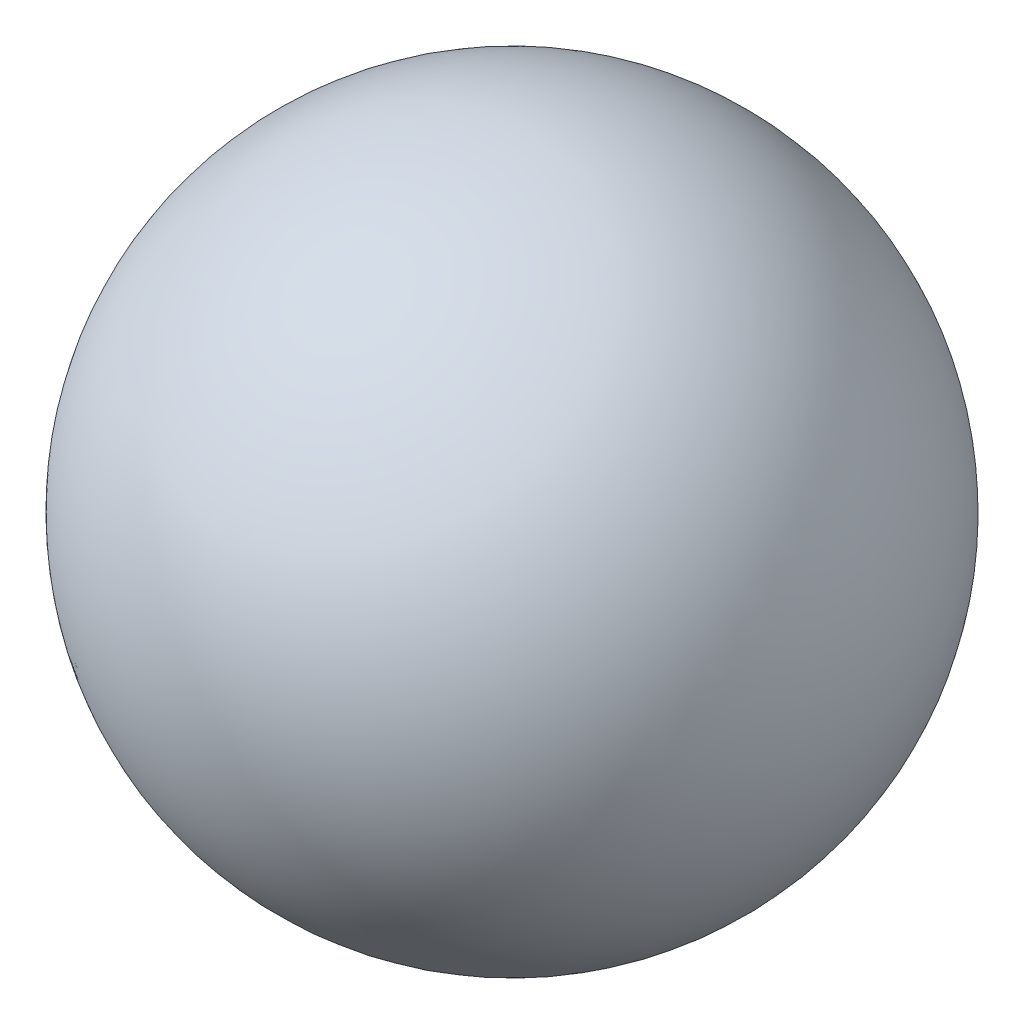
ISO-10303-21;
HEADER;
FILE_DESCRIPTION(('STEP AP214'),'2;1');
FILE_NAME('part.step','',(''),(''),'','','');
FILE_SCHEMA(('AUTOMOTIVE_DESIGN { 1 0 10303 214 1 1 1 1 }'));
ENDSEC;
DATA;
#1=APPLICATION_CONTEXT('core data for automotive mechanical design processes');
#2=APPLICATION_PROTOCOL_DEFINITION('international standard','automotive_design',2000,#1);
#3=PRODUCT_CONTEXT('',#1,'mechanical');
#4=PRODUCT('Part','Part','',(#3));
#5=PRODUCT_RELATED_PRODUCT_CATEGORY('part','',(#4));
#6=PRODUCT_DEFINITION_FORMATION('','',#4);
#7=PRODUCT_DEFINITION_CONTEXT('part definition',#1,'design');
#8=PRODUCT_DEFINITION('design','',#6,#7);
#9=PRODUCT_DEFINITION_SHAPE('','',#8);
#10=(LENGTH_UNIT() NAMED_UNIT(*) SI_UNIT(.MILLI.,.METRE.));
#11=(NAMED_UNIT(*) PLANE_ANGLE_UNIT() SI_UNIT($,.RADIAN.));
#12=(NAMED_UNIT(*) SI_UNIT($,.STERADIAN.) SOLID_ANGLE_UNIT());
#13=UNCERTAINTY_MEASURE_WITH_UNIT(LENGTH_MEASURE(1.E-05),#10,'distance_accuracy_value','');
#14=(GEOMETRIC_REPRESENTATION_CONTEXT(3) GLOBAL_UNCERTAINTY_ASSIGNED_CONTEXT((#13)) GLOBAL_UNIT_ASSIGNED_CONTEXT((#10,
#11,#12)) REPRESENTATION_CONTEXT('',''));
#15=CARTESIAN_POINT('',(0.,0.,0.));
#16=DIRECTION('',(0.,0.,1.));
#17=DIRECTION('',(1.,0.,0.));
#18=AXIS2_PLACEMENT_3D('',#15,#16,#17);
#19=CARTESIAN_POINT('',(0.,-2.36880771697495,-2.36880771697492));
#20=DIRECTION('',(0.0632926493718599,0.39825974424842,0.915086453099746));
#21=DIRECTION('',(-0.627715645181082,-0.696953102688074,0.346741173569516));
#22=AXIS2_PLACEMENT_3D('',#19,#20,#21);
#23=SPHERICAL_SURFACE('',#22,0.794);
#24=CARTESIAN_POINT('',(0.0502543636012567,-2.0525894800417,-1.64222907321372));
#25=VERTEX_POINT('',#24);
#26=VERTEX_LOOP('',#25);
#27=FACE_BOUND('',#26,.T.);
#28=CARTESIAN_POINT('',(-0.0502543636012568,-2.68502595390819,-3.09538636073612));
#29=VERTEX_POINT('',#28);
#30=VERTEX_LOOP('',#29);
#31=FACE_BOUND('',#30,.T.);
#32=ADVANCED_FACE('F16',(#27,#31),#23,.T.);
#33=CLOSED_SHELL('',(#32));
#34=MANIFOLD_SOLID_BREP('B1',#33);
#35=ADVANCED_BREP_SHAPE_REPRESENTATION('',(#18,#34),#14);
#36=SHAPE_DEFINITION_REPRESENTATION(#9,#35);
ENDSEC;
END-ISO-10303-21;
